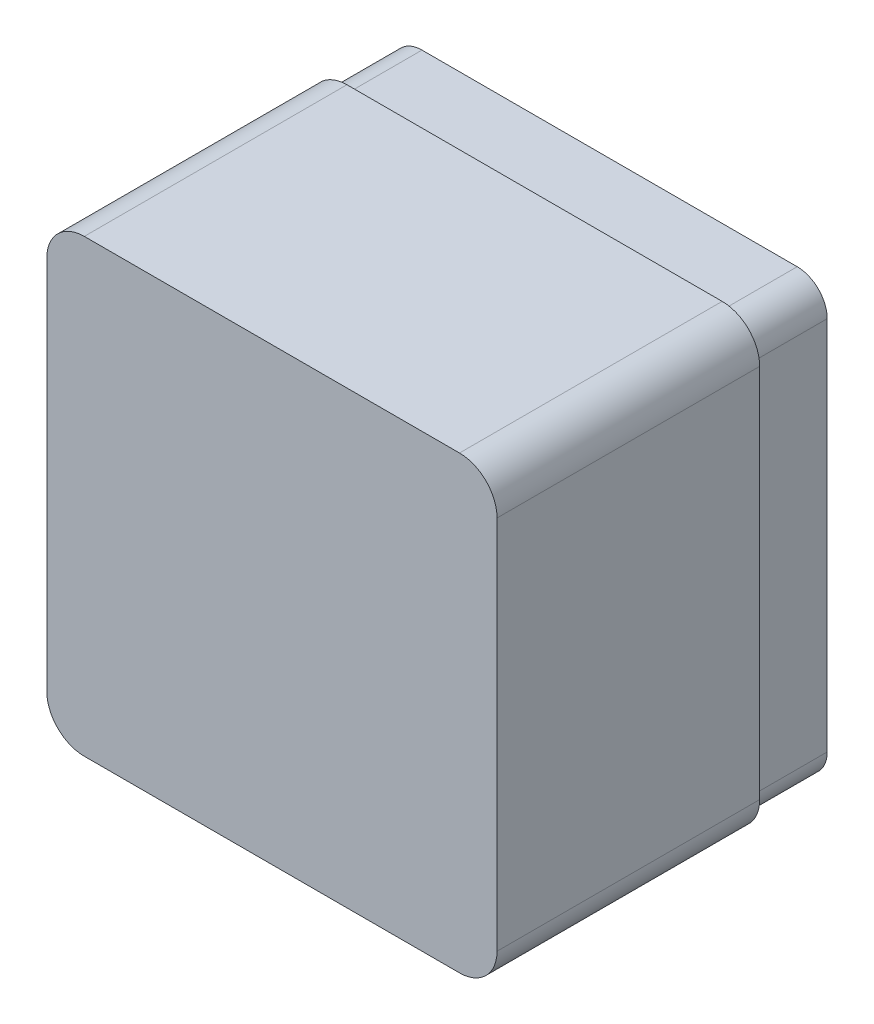
ISO-10303-21;
HEADER;
FILE_DESCRIPTION(('STEP AP214'),'2;1');
FILE_NAME('part.step','',(''),(''),'','','');
FILE_SCHEMA(('AUTOMOTIVE_DESIGN { 1 0 10303 214 1 1 1 1 }'));
ENDSEC;
DATA;
#1=APPLICATION_CONTEXT('core data for automotive mechanical design processes');
#2=APPLICATION_PROTOCOL_DEFINITION('international standard','automotive_design',2000,#1);
#3=PRODUCT_CONTEXT('',#1,'mechanical');
#4=PRODUCT('Part','Part','',(#3));
#5=PRODUCT_RELATED_PRODUCT_CATEGORY('part','',(#4));
#6=PRODUCT_DEFINITION_FORMATION('','',#4);
#7=PRODUCT_DEFINITION_CONTEXT('part definition',#1,'design');
#8=PRODUCT_DEFINITION('design','',#6,#7);
#9=PRODUCT_DEFINITION_SHAPE('','',#8);
#10=(LENGTH_UNIT() NAMED_UNIT(*) SI_UNIT(.MILLI.,.METRE.));
#11=(NAMED_UNIT(*) PLANE_ANGLE_UNIT() SI_UNIT($,.RADIAN.));
#12=(NAMED_UNIT(*) SI_UNIT($,.STERADIAN.) SOLID_ANGLE_UNIT());
#13=UNCERTAINTY_MEASURE_WITH_UNIT(LENGTH_MEASURE(1.E-05),#10,'distance_accuracy_value','');
#14=(GEOMETRIC_REPRESENTATION_CONTEXT(3) GLOBAL_UNCERTAINTY_ASSIGNED_CONTEXT((#13)) GLOBAL_UNIT_ASSIGNED_CONTEXT((#10,
#11,#12)) REPRESENTATION_CONTEXT('',''));
#15=CARTESIAN_POINT('',(0.,0.,0.));
#16=DIRECTION('',(0.,0.,1.));
#17=DIRECTION('',(1.,0.,0.));
#18=AXIS2_PLACEMENT_3D('',#15,#16,#17);
#19=CARTESIAN_POINT('',(0.,0.,0.));
#20=DIRECTION('',(0.,0.,-1.));
#21=DIRECTION('',(-1.,0.,0.));
#22=AXIS2_PLACEMENT_3D('',#19,#20,#21);
#23=PLANE('',#22);
#24=DIRECTION('',(1.,0.,0.));
#25=VECTOR('',#24,1.);
#26=CARTESIAN_POINT('',(0.,116.,0.));
#27=LINE('',#26,#25);
#28=CARTESIAN_POINT('',(10.0000000000001,116.,0.));
#29=VERTEX_POINT('',#28);
#30=CARTESIAN_POINT('',(110.,116.,0.));
#31=VERTEX_POINT('',#30);
#32=EDGE_CURVE('E329',#29,#31,#27,.T.);
#33=ORIENTED_EDGE('',*,*,#32,.F.);
#34=CARTESIAN_POINT('',(10.0000000000001,110.,0.));
#35=DIRECTION('',(0.,0.,-1.));
#36=DIRECTION('',(-1.,0.,0.));
#37=AXIS2_PLACEMENT_3D('',#34,#35,#36);
#38=CIRCLE('',#37,6.);
#39=CARTESIAN_POINT('',(4.00000000000007,110.,0.));
#40=VERTEX_POINT('',#39);
#41=EDGE_CURVE('E326',#40,#29,#38,.T.);
#42=ORIENTED_EDGE('',*,*,#41,.F.);
#43=DIRECTION('',(0.,1.,0.));
#44=VECTOR('',#43,1.);
#45=CARTESIAN_POINT('',(4.,0.,0.));
#46=LINE('',#45,#44);
#47=CARTESIAN_POINT('',(4.00000000000001,10.,0.));
#48=VERTEX_POINT('',#47);
#49=EDGE_CURVE('E286',#48,#40,#46,.T.);
#50=ORIENTED_EDGE('',*,*,#49,.F.);
#51=CARTESIAN_POINT('',(10.,10.,0.));
#52=DIRECTION('',(0.,0.,-1.));
#53=DIRECTION('',(-1.,0.,0.));
#54=AXIS2_PLACEMENT_3D('',#51,#52,#53);
#55=CIRCLE('',#54,6.);
#56=CARTESIAN_POINT('',(10.,4.,0.));
#57=VERTEX_POINT('',#56);
#58=EDGE_CURVE('E336',#57,#48,#55,.T.);
#59=ORIENTED_EDGE('',*,*,#58,.F.);
#60=DIRECTION('',(1.,0.,0.));
#61=VECTOR('',#60,1.);
#62=CARTESIAN_POINT('',(0.,4.,0.));
#63=LINE('',#62,#61);
#64=CARTESIAN_POINT('',(110.,4.,0.));
#65=VERTEX_POINT('',#64);
#66=EDGE_CURVE('E295',#57,#65,#63,.T.);
#67=ORIENTED_EDGE('',*,*,#66,.T.);
#68=CARTESIAN_POINT('',(110.,10.,0.));
#69=DIRECTION('',(0.,0.,-1.));
#70=DIRECTION('',(-1.,0.,0.));
#71=AXIS2_PLACEMENT_3D('',#68,#69,#70);
#72=CIRCLE('',#71,6.);
#73=CARTESIAN_POINT('',(116.,10.,0.));
#74=VERTEX_POINT('',#73);
#75=EDGE_CURVE('E331',#74,#65,#72,.T.);
#76=ORIENTED_EDGE('',*,*,#75,.F.);
#77=DIRECTION('',(0.,1.,0.));
#78=VECTOR('',#77,1.);
#79=CARTESIAN_POINT('',(116.,0.,0.));
#80=LINE('',#79,#78);
#81=CARTESIAN_POINT('',(116.,110.,0.));
#82=VERTEX_POINT('',#81);
#83=EDGE_CURVE('E334',#74,#82,#80,.T.);
#84=ORIENTED_EDGE('',*,*,#83,.T.);
#85=CARTESIAN_POINT('',(110.,110.,0.));
#86=DIRECTION('',(0.,0.,-1.));
#87=DIRECTION('',(-1.,0.,0.));
#88=AXIS2_PLACEMENT_3D('',#85,#86,#87);
#89=CIRCLE('',#88,6.);
#90=EDGE_CURVE('E322',#31,#82,#89,.T.);
#91=ORIENTED_EDGE('',*,*,#90,.F.);
#92=EDGE_LOOP('',(#33,#42,#50,#59,#67,#76,#84,#91));
#93=FACE_BOUND('',#92,.T.);
#94=DIRECTION('',(0.,1.,0.));
#95=VECTOR('',#94,1.);
#96=CARTESIAN_POINT('',(2.00000000000001,10.,0.));
#97=LINE('',#96,#95);
#98=CARTESIAN_POINT('',(2.00000000000001,10.,0.));
#99=VERTEX_POINT('',#98);
#100=CARTESIAN_POINT('',(2.00000000000001,110.,0.));
#101=VERTEX_POINT('',#100);
#102=EDGE_CURVE('E224',#99,#101,#97,.T.);
#103=ORIENTED_EDGE('',*,*,#102,.T.);
#104=CARTESIAN_POINT('',(10.0000000000001,110.,0.));
#105=DIRECTION('',(0.,0.,-1.));
#106=DIRECTION('',(-1.,0.,0.));
#107=AXIS2_PLACEMENT_3D('',#104,#105,#106);
#108=CIRCLE('',#107,8.00000000000003);
#109=CARTESIAN_POINT('',(10.0000000000001,118.,0.));
#110=VERTEX_POINT('',#109);
#111=EDGE_CURVE('E244',#101,#110,#108,.T.);
#112=ORIENTED_EDGE('',*,*,#111,.T.);
#113=DIRECTION('',(1.,0.,0.));
#114=VECTOR('',#113,1.);
#115=CARTESIAN_POINT('',(10.0000000000001,118.,0.));
#116=LINE('',#115,#114);
#117=CARTESIAN_POINT('',(110.,118.,0.));
#118=VERTEX_POINT('',#117);
#119=EDGE_CURVE('E204',#110,#118,#116,.T.);
#120=ORIENTED_EDGE('',*,*,#119,.T.);
#121=CARTESIAN_POINT('',(110.,110.,0.));
#122=DIRECTION('',(0.,0.,-1.));
#123=DIRECTION('',(-1.,0.,0.));
#124=AXIS2_PLACEMENT_3D('',#121,#122,#123);
#125=CIRCLE('',#124,7.99999999999999);
#126=CARTESIAN_POINT('',(118.,110.,0.));
#127=VERTEX_POINT('',#126);
#128=EDGE_CURVE('E53',#118,#127,#125,.T.);
#129=ORIENTED_EDGE('',*,*,#128,.T.);
#130=DIRECTION('',(0.,-1.,0.));
#131=VECTOR('',#130,1.);
#132=CARTESIAN_POINT('',(118.,110.,0.));
#133=LINE('',#132,#131);
#134=CARTESIAN_POINT('',(118.,9.99999999999999,0.));
#135=VERTEX_POINT('',#134);
#136=EDGE_CURVE('E248',#127,#135,#133,.T.);
#137=ORIENTED_EDGE('',*,*,#136,.T.);
#138=CARTESIAN_POINT('',(110.,10.,0.));
#139=DIRECTION('',(0.,0.,-1.));
#140=DIRECTION('',(-1.,0.,0.));
#141=AXIS2_PLACEMENT_3D('',#138,#139,#140);
#142=CIRCLE('',#141,7.99999999999998);
#143=CARTESIAN_POINT('',(110.,2.00000000000002,0.));
#144=VERTEX_POINT('',#143);
#145=EDGE_CURVE('E251',#135,#144,#142,.T.);
#146=ORIENTED_EDGE('',*,*,#145,.T.);
#147=DIRECTION('',(-1.,0.,0.));
#148=VECTOR('',#147,1.);
#149=CARTESIAN_POINT('',(110.,2.,0.));
#150=LINE('',#149,#148);
#151=CARTESIAN_POINT('',(10.,2.,0.));
#152=VERTEX_POINT('',#151);
#153=EDGE_CURVE('E254',#144,#152,#150,.T.);
#154=ORIENTED_EDGE('',*,*,#153,.T.);
#155=CARTESIAN_POINT('',(10.,10.,0.));
#156=DIRECTION('',(0.,0.,-1.));
#157=DIRECTION('',(-1.,0.,0.));
#158=AXIS2_PLACEMENT_3D('',#155,#156,#157);
#159=CIRCLE('',#158,8.);
#160=EDGE_CURVE('E227',#152,#99,#159,.T.);
#161=ORIENTED_EDGE('',*,*,#160,.T.);
#162=EDGE_LOOP('',(#103,#112,#120,#129,#137,#146,#154,#161));
#163=FACE_BOUND('',#162,.T.);
#164=ADVANCED_FACE('F38',(#93,#163),#23,.T.);
#165=CARTESIAN_POINT('',(4.,0.,90.));
#166=DIRECTION('',(-1.,0.,0.));
#167=DIRECTION('',(0.,-1.,0.));
#168=AXIS2_PLACEMENT_3D('',#165,#166,#167);
#169=PLANE('',#168);
#170=ORIENTED_EDGE('',*,*,#49,.T.);
#171=DIRECTION('',(0.,0.,1.));
#172=VECTOR('',#171,1.);
#173=CARTESIAN_POINT('',(4.00000000000008,110.,90.));
#174=LINE('',#173,#172);
#175=CARTESIAN_POINT('',(4.00000000000008,110.,86.));
#176=VERTEX_POINT('',#175);
#177=EDGE_CURVE('E290',#176,#40,#174,.F.);
#178=ORIENTED_EDGE('',*,*,#177,.F.);
#179=DIRECTION('',(0.,1.,0.));
#180=VECTOR('',#179,1.);
#181=CARTESIAN_POINT('',(4.,0.,86.));
#182=LINE('',#181,#180);
#183=CARTESIAN_POINT('',(4.00000000000001,10.,86.));
#184=VERTEX_POINT('',#183);
#185=EDGE_CURVE('E291',#184,#176,#182,.T.);
#186=ORIENTED_EDGE('',*,*,#185,.F.);
#187=DIRECTION('',(0.,0.,1.));
#188=VECTOR('',#187,1.);
#189=CARTESIAN_POINT('',(4.00000000000001,10.,90.));
#190=LINE('',#189,#188);
#191=EDGE_CURVE('E287',#48,#184,#190,.T.);
#192=ORIENTED_EDGE('',*,*,#191,.F.);
#193=EDGE_LOOP('',(#170,#178,#186,#192));
#194=FACE_BOUND('',#193,.T.);
#195=ADVANCED_FACE('F428',(#194),#169,.F.);
#196=CARTESIAN_POINT('',(0.,4.,90.));
#197=DIRECTION('',(0.,1.,0.));
#198=DIRECTION('',(0.,0.,1.));
#199=AXIS2_PLACEMENT_3D('',#196,#197,#198);
#200=PLANE('',#199);
#201=DIRECTION('',(1.,0.,0.));
#202=VECTOR('',#201,1.);
#203=CARTESIAN_POINT('',(0.,4.,86.));
#204=LINE('',#203,#202);
#205=CARTESIAN_POINT('',(10.,4.,86.));
#206=VERTEX_POINT('',#205);
#207=CARTESIAN_POINT('',(110.,4.,86.));
#208=VERTEX_POINT('',#207);
#209=EDGE_CURVE('E302',#206,#208,#204,.T.);
#210=ORIENTED_EDGE('',*,*,#209,.T.);
#211=DIRECTION('',(0.,0.,1.));
#212=VECTOR('',#211,1.);
#213=CARTESIAN_POINT('',(110.,4.,90.));
#214=LINE('',#213,#212);
#215=EDGE_CURVE('E305',#65,#208,#214,.T.);
#216=ORIENTED_EDGE('',*,*,#215,.F.);
#217=ORIENTED_EDGE('',*,*,#66,.F.);
#218=DIRECTION('',(0.,0.,1.));
#219=VECTOR('',#218,1.);
#220=CARTESIAN_POINT('',(10.,4.,90.));
#221=LINE('',#220,#219);
#222=EDGE_CURVE('E298',#206,#57,#221,.F.);
#223=ORIENTED_EDGE('',*,*,#222,.F.);
#224=EDGE_LOOP('',(#210,#216,#217,#223));
#225=FACE_BOUND('',#224,.T.);
#226=ADVANCED_FACE('F433',(#225),#200,.T.);
#227=CARTESIAN_POINT('',(116.,0.,90.));
#228=DIRECTION('',(-1.,0.,0.));
#229=DIRECTION('',(0.,-1.,0.));
#230=AXIS2_PLACEMENT_3D('',#227,#228,#229);
#231=PLANE('',#230);
#232=ORIENTED_EDGE('',*,*,#83,.F.);
#233=DIRECTION('',(0.,0.,1.));
#234=VECTOR('',#233,1.);
#235=CARTESIAN_POINT('',(116.,10.,90.));
#236=LINE('',#235,#234);
#237=CARTESIAN_POINT('',(116.,10.,86.));
#238=VERTEX_POINT('',#237);
#239=EDGE_CURVE('E320',#238,#74,#236,.F.);
#240=ORIENTED_EDGE('',*,*,#239,.F.);
#241=DIRECTION('',(0.,1.,0.));
#242=VECTOR('',#241,1.);
#243=CARTESIAN_POINT('',(116.,0.,86.));
#244=LINE('',#243,#242);
#245=CARTESIAN_POINT('',(116.,110.,86.));
#246=VERTEX_POINT('',#245);
#247=EDGE_CURVE('E299',#238,#246,#244,.T.);
#248=ORIENTED_EDGE('',*,*,#247,.T.);
#249=DIRECTION('',(0.,0.,1.));
#250=VECTOR('',#249,1.);
#251=CARTESIAN_POINT('',(116.,110.,90.));
#252=LINE('',#251,#250);
#253=EDGE_CURVE('E312',#82,#246,#252,.T.);
#254=ORIENTED_EDGE('',*,*,#253,.F.);
#255=EDGE_LOOP('',(#232,#240,#248,#254));
#256=FACE_BOUND('',#255,.T.);
#257=ADVANCED_FACE('F615',(#256),#231,.T.);
#258=CARTESIAN_POINT('',(0.,116.,90.));
#259=DIRECTION('',(0.,1.,0.));
#260=DIRECTION('',(0.,0.,1.));
#261=AXIS2_PLACEMENT_3D('',#258,#259,#260);
#262=PLANE('',#261);
#263=DIRECTION('',(1.,0.,0.));
#264=VECTOR('',#263,1.);
#265=CARTESIAN_POINT('',(0.,116.,86.));
#266=LINE('',#265,#264);
#267=CARTESIAN_POINT('',(10.0000000000001,116.,86.));
#268=VERTEX_POINT('',#267);
#269=CARTESIAN_POINT('',(110.,116.,86.));
#270=VERTEX_POINT('',#269);
#271=EDGE_CURVE('E294',#268,#270,#266,.T.);
#272=ORIENTED_EDGE('',*,*,#271,.F.);
#273=DIRECTION('',(0.,0.,1.));
#274=VECTOR('',#273,1.);
#275=CARTESIAN_POINT('',(10.0000000000001,116.,90.));
#276=LINE('',#275,#274);
#277=EDGE_CURVE('E316',#29,#268,#276,.T.);
#278=ORIENTED_EDGE('',*,*,#277,.F.);
#279=ORIENTED_EDGE('',*,*,#32,.T.);
#280=DIRECTION('',(0.,0.,1.));
#281=VECTOR('',#280,1.);
#282=CARTESIAN_POINT('',(110.,116.,90.));
#283=LINE('',#282,#281);
#284=EDGE_CURVE('E324',#270,#31,#283,.F.);
#285=ORIENTED_EDGE('',*,*,#284,.F.);
#286=EDGE_LOOP('',(#272,#278,#279,#285));
#287=FACE_BOUND('',#286,.T.);
#288=ADVANCED_FACE('F606',(#287),#262,.F.);
#289=CARTESIAN_POINT('',(0.,0.,86.));
#290=DIRECTION('',(0.,0.,-1.));
#291=DIRECTION('',(-1.,0.,0.));
#292=AXIS2_PLACEMENT_3D('',#289,#290,#291);
#293=PLANE('',#292);
#294=ORIENTED_EDGE('',*,*,#247,.F.);
#295=CARTESIAN_POINT('',(110.,10.,86.));
#296=DIRECTION('',(0.,0.,-1.));
#297=DIRECTION('',(-1.,0.,0.));
#298=AXIS2_PLACEMENT_3D('',#295,#296,#297);
#299=CIRCLE('',#298,6.);
#300=EDGE_CURVE('E311',#208,#238,#299,.F.);
#301=ORIENTED_EDGE('',*,*,#300,.F.);
#302=ORIENTED_EDGE('',*,*,#209,.F.);
#303=CARTESIAN_POINT('',(10.,10.,86.));
#304=DIRECTION('',(0.,0.,-1.));
#305=DIRECTION('',(-1.,0.,0.));
#306=AXIS2_PLACEMENT_3D('',#303,#304,#305);
#307=CIRCLE('',#306,6.);
#308=EDGE_CURVE('E306',#184,#206,#307,.F.);
#309=ORIENTED_EDGE('',*,*,#308,.F.);
#310=ORIENTED_EDGE('',*,*,#185,.T.);
#311=CARTESIAN_POINT('',(10.0000000000001,110.,86.));
#312=DIRECTION('',(0.,0.,-1.));
#313=DIRECTION('',(-1.,0.,0.));
#314=AXIS2_PLACEMENT_3D('',#311,#312,#313);
#315=CIRCLE('',#314,6.);
#316=EDGE_CURVE('E309',#268,#176,#315,.F.);
#317=ORIENTED_EDGE('',*,*,#316,.F.);
#318=ORIENTED_EDGE('',*,*,#271,.T.);
#319=CARTESIAN_POINT('',(110.,110.,86.));
#320=DIRECTION('',(0.,0.,-1.));
#321=DIRECTION('',(-1.,0.,0.));
#322=AXIS2_PLACEMENT_3D('',#319,#320,#321);
#323=CIRCLE('',#322,6.);
#324=EDGE_CURVE('E303',#246,#270,#323,.F.);
#325=ORIENTED_EDGE('',*,*,#324,.F.);
#326=EDGE_LOOP('',(#294,#301,#302,#309,#310,#317,#318,#325));
#327=FACE_BOUND('',#326,.T.);
#328=ADVANCED_FACE('F597',(#327),#293,.T.);
#329=CARTESIAN_POINT('',(110.,110.,90.));
#330=DIRECTION('',(0.,0.,1.));
#331=DIRECTION('',(1.,0.,0.));
#332=AXIS2_PLACEMENT_3D('',#329,#330,#331);
#333=CYLINDRICAL_SURFACE('',#332,6.);
#334=ORIENTED_EDGE('',*,*,#324,.T.);
#335=ORIENTED_EDGE('',*,*,#284,.T.);
#336=ORIENTED_EDGE('',*,*,#90,.T.);
#337=ORIENTED_EDGE('',*,*,#253,.T.);
#338=EDGE_LOOP('',(#334,#335,#336,#337));
#339=FACE_BOUND('',#338,.T.);
#340=ADVANCED_FACE('F588',(#339),#333,.F.);
#341=CARTESIAN_POINT('',(10.,10.,90.));
#342=DIRECTION('',(0.,0.,1.));
#343=DIRECTION('',(1.,0.,0.));
#344=AXIS2_PLACEMENT_3D('',#341,#342,#343);
#345=CYLINDRICAL_SURFACE('',#344,6.);
#346=ORIENTED_EDGE('',*,*,#308,.T.);
#347=ORIENTED_EDGE('',*,*,#222,.T.);
#348=ORIENTED_EDGE('',*,*,#58,.T.);
#349=ORIENTED_EDGE('',*,*,#191,.T.);
#350=EDGE_LOOP('',(#346,#347,#348,#349));
#351=FACE_BOUND('',#350,.T.);
#352=ADVANCED_FACE('F579',(#351),#345,.F.);
#353=CARTESIAN_POINT('',(110.,10.,90.));
#354=DIRECTION('',(0.,0.,-1.));
#355=DIRECTION('',(-1.,0.,0.));
#356=AXIS2_PLACEMENT_3D('',#353,#354,#355);
#357=CYLINDRICAL_SURFACE('',#356,6.);
#358=ORIENTED_EDGE('',*,*,#300,.T.);
#359=ORIENTED_EDGE('',*,*,#239,.T.);
#360=ORIENTED_EDGE('',*,*,#75,.T.);
#361=ORIENTED_EDGE('',*,*,#215,.T.);
#362=EDGE_LOOP('',(#358,#359,#360,#361));
#363=FACE_BOUND('',#362,.T.);
#364=ADVANCED_FACE('F571',(#363),#357,.F.);
#365=CARTESIAN_POINT('',(10.0000000000001,110.,90.));
#366=DIRECTION('',(0.,0.,-1.));
#367=DIRECTION('',(-1.,0.,0.));
#368=AXIS2_PLACEMENT_3D('',#365,#366,#367);
#369=CYLINDRICAL_SURFACE('',#368,6.);
#370=ORIENTED_EDGE('',*,*,#316,.T.);
#371=ORIENTED_EDGE('',*,*,#177,.T.);
#372=ORIENTED_EDGE('',*,*,#41,.T.);
#373=ORIENTED_EDGE('',*,*,#277,.T.);
#374=EDGE_LOOP('',(#370,#371,#372,#373));
#375=FACE_BOUND('',#374,.T.);
#376=ADVANCED_FACE('F486',(#375),#369,.F.);
#377=CARTESIAN_POINT('',(10.0000000000001,110.,20.));
#378=DIRECTION('',(0.,0.,-1.));
#379=DIRECTION('',(-1.,0.,0.));
#380=AXIS2_PLACEMENT_3D('',#377,#378,#379);
#381=PLANE('',#380);
#382=DIRECTION('',(0.,1.,0.));
#383=VECTOR('',#382,1.);
#384=CARTESIAN_POINT('',(2.00000000000001,10.,20.));
#385=LINE('',#384,#383);
#386=CARTESIAN_POINT('',(2.00000000000001,10.,20.));
#387=VERTEX_POINT('',#386);
#388=CARTESIAN_POINT('',(2.00000000000001,110.,20.));
#389=VERTEX_POINT('',#388);
#390=EDGE_CURVE('E210',#387,#389,#385,.T.);
#391=ORIENTED_EDGE('',*,*,#390,.F.);
#392=CARTESIAN_POINT('',(10.,10.,20.));
#393=DIRECTION('',(0.,0.,-1.));
#394=DIRECTION('',(-1.,0.,0.));
#395=AXIS2_PLACEMENT_3D('',#392,#393,#394);
#396=CIRCLE('',#395,8.);
#397=CARTESIAN_POINT('',(10.,2.,20.));
#398=VERTEX_POINT('',#397);
#399=EDGE_CURVE('E240',#398,#387,#396,.T.);
#400=ORIENTED_EDGE('',*,*,#399,.F.);
#401=DIRECTION('',(-1.,0.,0.));
#402=VECTOR('',#401,1.);
#403=CARTESIAN_POINT('',(110.,2.,20.));
#404=LINE('',#403,#402);
#405=CARTESIAN_POINT('',(110.,2.00000000000002,20.));
#406=VERTEX_POINT('',#405);
#407=EDGE_CURVE('E237',#406,#398,#404,.T.);
#408=ORIENTED_EDGE('',*,*,#407,.F.);
#409=CARTESIAN_POINT('',(110.,10.,20.));
#410=DIRECTION('',(0.,0.,-1.));
#411=DIRECTION('',(-1.,0.,0.));
#412=AXIS2_PLACEMENT_3D('',#409,#410,#411);
#413=CIRCLE('',#412,7.99999999999998);
#414=CARTESIAN_POINT('',(118.,9.99999999999999,20.));
#415=VERTEX_POINT('',#414);
#416=EDGE_CURVE('E234',#415,#406,#413,.T.);
#417=ORIENTED_EDGE('',*,*,#416,.F.);
#418=DIRECTION('',(0.,-1.,0.));
#419=VECTOR('',#418,1.);
#420=CARTESIAN_POINT('',(118.,110.,20.));
#421=LINE('',#420,#419);
#422=CARTESIAN_POINT('',(118.,110.,20.));
#423=VERTEX_POINT('',#422);
#424=EDGE_CURVE('E231',#423,#415,#421,.T.);
#425=ORIENTED_EDGE('',*,*,#424,.F.);
#426=CARTESIAN_POINT('',(110.,110.,20.));
#427=DIRECTION('',(0.,0.,-1.));
#428=DIRECTION('',(-1.,0.,0.));
#429=AXIS2_PLACEMENT_3D('',#426,#427,#428);
#430=CIRCLE('',#429,7.99999999999999);
#431=CARTESIAN_POINT('',(110.,118.,20.));
#432=VERTEX_POINT('',#431);
#433=EDGE_CURVE('E220',#432,#423,#430,.T.);
#434=ORIENTED_EDGE('',*,*,#433,.F.);
#435=DIRECTION('',(1.,0.,0.));
#436=VECTOR('',#435,1.);
#437=CARTESIAN_POINT('',(10.0000000000001,118.,20.));
#438=LINE('',#437,#436);
#439=CARTESIAN_POINT('',(10.0000000000001,118.,20.));
#440=VERTEX_POINT('',#439);
#441=EDGE_CURVE('E202',#440,#432,#438,.T.);
#442=ORIENTED_EDGE('',*,*,#441,.F.);
#443=CARTESIAN_POINT('',(10.0000000000001,110.,20.));
#444=DIRECTION('',(0.,0.,-1.));
#445=DIRECTION('',(-1.,0.,0.));
#446=AXIS2_PLACEMENT_3D('',#443,#444,#445);
#447=CIRCLE('',#446,8.00000000000003);
#448=EDGE_CURVE('E216',#389,#440,#447,.T.);
#449=ORIENTED_EDGE('',*,*,#448,.F.);
#450=EDGE_LOOP('',(#391,#400,#408,#417,#425,#434,#442,#449));
#451=FACE_BOUND('',#450,.T.);
#452=CARTESIAN_POINT('',(10.0000000000001,110.,20.));
#453=DIRECTION('',(0.,0.,-1.));
#454=DIRECTION('',(-1.,0.,0.));
#455=AXIS2_PLACEMENT_3D('',#452,#453,#454);
#456=CIRCLE('',#455,10.);
#457=CARTESIAN_POINT('',(0.,110.,20.));
#458=VERTEX_POINT('',#457);
#459=CARTESIAN_POINT('',(10.0000000000001,120.,20.));
#460=VERTEX_POINT('',#459);
#461=EDGE_CURVE('E260',#458,#460,#456,.T.);
#462=ORIENTED_EDGE('',*,*,#461,.T.);
#463=DIRECTION('',(1.,0.,0.));
#464=VECTOR('',#463,1.);
#465=CARTESIAN_POINT('',(10.0000000000001,120.,20.));
#466=LINE('',#465,#464);
#467=CARTESIAN_POINT('',(110.,120.,20.));
#468=VERTEX_POINT('',#467);
#469=EDGE_CURVE('E273',#460,#468,#466,.T.);
#470=ORIENTED_EDGE('',*,*,#469,.T.);
#471=CARTESIAN_POINT('',(110.,110.,20.));
#472=DIRECTION('',(0.,0.,-1.));
#473=DIRECTION('',(-1.,0.,0.));
#474=AXIS2_PLACEMENT_3D('',#471,#472,#473);
#475=CIRCLE('',#474,9.99999999999999);
#476=CARTESIAN_POINT('',(120.,110.,20.));
#477=VERTEX_POINT('',#476);
#478=EDGE_CURVE('E275',#468,#477,#475,.T.);
#479=ORIENTED_EDGE('',*,*,#478,.T.);
#480=DIRECTION('',(0.,-1.,0.));
#481=VECTOR('',#480,1.);
#482=CARTESIAN_POINT('',(120.,110.,20.));
#483=LINE('',#482,#481);
#484=CARTESIAN_POINT('',(120.,10.,20.));
#485=VERTEX_POINT('',#484);
#486=EDGE_CURVE('E277',#477,#485,#483,.T.);
#487=ORIENTED_EDGE('',*,*,#486,.T.);
#488=CARTESIAN_POINT('',(110.,10.,20.));
#489=DIRECTION('',(0.,0.,-1.));
#490=DIRECTION('',(-1.,0.,0.));
#491=AXIS2_PLACEMENT_3D('',#488,#489,#490);
#492=CIRCLE('',#491,9.99999999999999);
#493=CARTESIAN_POINT('',(110.,0.,20.));
#494=VERTEX_POINT('',#493);
#495=EDGE_CURVE('E279',#485,#494,#492,.T.);
#496=ORIENTED_EDGE('',*,*,#495,.T.);
#497=DIRECTION('',(-1.,0.,0.));
#498=VECTOR('',#497,1.);
#499=CARTESIAN_POINT('',(110.,0.,20.));
#500=LINE('',#499,#498);
#501=CARTESIAN_POINT('',(10.,0.,20.));
#502=VERTEX_POINT('',#501);
#503=EDGE_CURVE('E281',#494,#502,#500,.T.);
#504=ORIENTED_EDGE('',*,*,#503,.T.);
#505=CARTESIAN_POINT('',(10.,10.,20.));
#506=DIRECTION('',(0.,0.,-1.));
#507=DIRECTION('',(-1.,0.,0.));
#508=AXIS2_PLACEMENT_3D('',#505,#506,#507);
#509=CIRCLE('',#508,10.);
#510=CARTESIAN_POINT('',(0.,10.,20.));
#511=VERTEX_POINT('',#510);
#512=EDGE_CURVE('E283',#502,#511,#509,.T.);
#513=ORIENTED_EDGE('',*,*,#512,.T.);
#514=DIRECTION('',(0.,1.,0.));
#515=VECTOR('',#514,1.);
#516=CARTESIAN_POINT('',(0.,10.,20.));
#517=LINE('',#516,#515);
#518=EDGE_CURVE('E61',#511,#458,#517,.T.);
#519=ORIENTED_EDGE('',*,*,#518,.T.);
#520=EDGE_LOOP('',(#462,#470,#479,#487,#496,#504,#513,#519));
#521=FACE_BOUND('',#520,.T.);
#522=ADVANCED_FACE('F215',(#451,#521),#381,.T.);
#523=CARTESIAN_POINT('',(10.0000000000001,110.,20.));
#524=DIRECTION('',(0.,0.,-1.));
#525=DIRECTION('',(-1.,0.,0.));
#526=AXIS2_PLACEMENT_3D('',#523,#524,#525);
#527=CYLINDRICAL_SURFACE('',#526,8.00000000000003);
#528=ORIENTED_EDGE('',*,*,#111,.F.);
#529=DIRECTION('',(0.,0.,-1.));
#530=VECTOR('',#529,1.);
#531=CARTESIAN_POINT('',(2.00000000000001,110.,20.));
#532=LINE('',#531,#530);
#533=EDGE_CURVE('E223',#389,#101,#532,.T.);
#534=ORIENTED_EDGE('',*,*,#533,.F.);
#535=ORIENTED_EDGE('',*,*,#448,.T.);
#536=DIRECTION('',(0.,0.,-1.));
#537=VECTOR('',#536,1.);
#538=CARTESIAN_POINT('',(10.0000000000001,118.,20.));
#539=LINE('',#538,#537);
#540=EDGE_CURVE('E199',#440,#110,#539,.T.);
#541=ORIENTED_EDGE('',*,*,#540,.T.);
#542=EDGE_LOOP('',(#528,#534,#535,#541));
#543=FACE_BOUND('',#542,.T.);
#544=ADVANCED_FACE('F222',(#543),#527,.T.);
#545=CARTESIAN_POINT('',(2.00000000000001,10.,20.));
#546=DIRECTION('',(-1.,0.,0.));
#547=DIRECTION('',(0.,-1.,0.));
#548=AXIS2_PLACEMENT_3D('',#545,#546,#547);
#549=PLANE('',#548);
#550=ORIENTED_EDGE('',*,*,#102,.F.);
#551=DIRECTION('',(0.,0.,-1.));
#552=VECTOR('',#551,1.);
#553=CARTESIAN_POINT('',(2.00000000000001,10.,20.));
#554=LINE('',#553,#552);
#555=EDGE_CURVE('E261',#387,#99,#554,.T.);
#556=ORIENTED_EDGE('',*,*,#555,.F.);
#557=ORIENTED_EDGE('',*,*,#390,.T.);
#558=ORIENTED_EDGE('',*,*,#533,.T.);
#559=EDGE_LOOP('',(#550,#556,#557,#558));
#560=FACE_BOUND('',#559,.T.);
#561=ADVANCED_FACE('F494',(#560),#549,.T.);
#562=CARTESIAN_POINT('',(10.,10.,20.));
#563=DIRECTION('',(0.,0.,-1.));
#564=DIRECTION('',(-1.,0.,0.));
#565=AXIS2_PLACEMENT_3D('',#562,#563,#564);
#566=CYLINDRICAL_SURFACE('',#565,8.);
#567=ORIENTED_EDGE('',*,*,#160,.F.);
#568=DIRECTION('',(0.,0.,-1.));
#569=VECTOR('',#568,1.);
#570=CARTESIAN_POINT('',(10.,2.,20.));
#571=LINE('',#570,#569);
#572=EDGE_CURVE('E263',#398,#152,#571,.T.);
#573=ORIENTED_EDGE('',*,*,#572,.F.);
#574=ORIENTED_EDGE('',*,*,#399,.T.);
#575=ORIENTED_EDGE('',*,*,#555,.T.);
#576=EDGE_LOOP('',(#567,#573,#574,#575));
#577=FACE_BOUND('',#576,.T.);
#578=ADVANCED_FACE('F502',(#577),#566,.T.);
#579=CARTESIAN_POINT('',(110.,2.,20.));
#580=DIRECTION('',(0.,-1.,0.));
#581=DIRECTION('',(1.,0.,0.));
#582=AXIS2_PLACEMENT_3D('',#579,#580,#581);
#583=PLANE('',#582);
#584=ORIENTED_EDGE('',*,*,#153,.F.);
#585=DIRECTION('',(0.,0.,-1.));
#586=VECTOR('',#585,1.);
#587=CARTESIAN_POINT('',(110.,2.00000000000002,20.));
#588=LINE('',#587,#586);
#589=EDGE_CURVE('E265',#406,#144,#588,.T.);
#590=ORIENTED_EDGE('',*,*,#589,.F.);
#591=ORIENTED_EDGE('',*,*,#407,.T.);
#592=ORIENTED_EDGE('',*,*,#572,.T.);
#593=EDGE_LOOP('',(#584,#590,#591,#592));
#594=FACE_BOUND('',#593,.T.);
#595=ADVANCED_FACE('F511',(#594),#583,.T.);
#596=CARTESIAN_POINT('',(110.,10.,20.));
#597=DIRECTION('',(0.,0.,-1.));
#598=DIRECTION('',(-1.,0.,0.));
#599=AXIS2_PLACEMENT_3D('',#596,#597,#598);
#600=CYLINDRICAL_SURFACE('',#599,7.99999999999998);
#601=ORIENTED_EDGE('',*,*,#145,.F.);
#602=DIRECTION('',(0.,0.,-1.));
#603=VECTOR('',#602,1.);
#604=CARTESIAN_POINT('',(118.,9.99999999999999,20.));
#605=LINE('',#604,#603);
#606=EDGE_CURVE('E267',#415,#135,#605,.T.);
#607=ORIENTED_EDGE('',*,*,#606,.F.);
#608=ORIENTED_EDGE('',*,*,#416,.T.);
#609=ORIENTED_EDGE('',*,*,#589,.T.);
#610=EDGE_LOOP('',(#601,#607,#608,#609));
#611=FACE_BOUND('',#610,.T.);
#612=ADVANCED_FACE('F520',(#611),#600,.T.);
#613=CARTESIAN_POINT('',(118.,110.,20.));
#614=DIRECTION('',(1.,0.,0.));
#615=DIRECTION('',(0.,0.,-1.));
#616=AXIS2_PLACEMENT_3D('',#613,#614,#615);
#617=PLANE('',#616);
#618=ORIENTED_EDGE('',*,*,#136,.F.);
#619=DIRECTION('',(0.,0.,-1.));
#620=VECTOR('',#619,1.);
#621=CARTESIAN_POINT('',(118.,110.,20.));
#622=LINE('',#621,#620);
#623=EDGE_CURVE('E269',#423,#127,#622,.T.);
#624=ORIENTED_EDGE('',*,*,#623,.F.);
#625=ORIENTED_EDGE('',*,*,#424,.T.);
#626=ORIENTED_EDGE('',*,*,#606,.T.);
#627=EDGE_LOOP('',(#618,#624,#625,#626));
#628=FACE_BOUND('',#627,.T.);
#629=ADVANCED_FACE('F529',(#628),#617,.T.);
#630=CARTESIAN_POINT('',(110.,110.,20.));
#631=DIRECTION('',(0.,0.,-1.));
#632=DIRECTION('',(-1.,0.,0.));
#633=AXIS2_PLACEMENT_3D('',#630,#631,#632);
#634=CYLINDRICAL_SURFACE('',#633,7.99999999999999);
#635=ORIENTED_EDGE('',*,*,#128,.F.);
#636=DIRECTION('',(0.,0.,-1.));
#637=VECTOR('',#636,1.);
#638=CARTESIAN_POINT('',(110.,118.,20.));
#639=LINE('',#638,#637);
#640=EDGE_CURVE('E209',#432,#118,#639,.T.);
#641=ORIENTED_EDGE('',*,*,#640,.F.);
#642=ORIENTED_EDGE('',*,*,#433,.T.);
#643=ORIENTED_EDGE('',*,*,#623,.T.);
#644=EDGE_LOOP('',(#635,#641,#642,#643));
#645=FACE_BOUND('',#644,.T.);
#646=ADVANCED_FACE('F423',(#645),#634,.T.);
#647=CARTESIAN_POINT('',(10.0000000000001,118.,20.));
#648=DIRECTION('',(0.,1.,0.));
#649=DIRECTION('',(0.,0.,1.));
#650=AXIS2_PLACEMENT_3D('',#647,#648,#649);
#651=PLANE('',#650);
#652=ORIENTED_EDGE('',*,*,#119,.F.);
#653=ORIENTED_EDGE('',*,*,#540,.F.);
#654=ORIENTED_EDGE('',*,*,#441,.T.);
#655=ORIENTED_EDGE('',*,*,#640,.T.);
#656=EDGE_LOOP('',(#652,#653,#654,#655));
#657=FACE_BOUND('',#656,.T.);
#658=ADVANCED_FACE('F201',(#657),#651,.T.);
#659=CARTESIAN_POINT('',(0.,0.,90.));
#660=DIRECTION('',(0.,0.,-1.));
#661=DIRECTION('',(-1.,0.,0.));
#662=AXIS2_PLACEMENT_3D('',#659,#660,#661);
#663=PLANE('',#662);
#664=DIRECTION('',(0.,1.,0.));
#665=VECTOR('',#664,1.);
#666=CARTESIAN_POINT('',(120.,0.,90.));
#667=LINE('',#666,#665);
#668=CARTESIAN_POINT('',(120.,10.,90.));
#669=VERTEX_POINT('',#668);
#670=CARTESIAN_POINT('',(120.,110.,90.));
#671=VERTEX_POINT('',#670);
#672=EDGE_CURVE('E348',#669,#671,#667,.T.);
#673=ORIENTED_EDGE('',*,*,#672,.T.);
#674=CARTESIAN_POINT('',(110.,110.,90.));
#675=DIRECTION('',(0.,0.,-1.));
#676=DIRECTION('',(-1.,0.,0.));
#677=AXIS2_PLACEMENT_3D('',#674,#675,#676);
#678=CIRCLE('',#677,10.);
#679=CARTESIAN_POINT('',(110.,120.,90.));
#680=VERTEX_POINT('',#679);
#681=EDGE_CURVE('E370',#671,#680,#678,.F.);
#682=ORIENTED_EDGE('',*,*,#681,.T.);
#683=DIRECTION('',(1.,0.,0.));
#684=VECTOR('',#683,1.);
#685=CARTESIAN_POINT('',(0.,120.,90.));
#686=LINE('',#685,#684);
#687=CARTESIAN_POINT('',(10.0000000000001,120.,90.));
#688=VERTEX_POINT('',#687);
#689=EDGE_CURVE('E345',#688,#680,#686,.T.);
#690=ORIENTED_EDGE('',*,*,#689,.F.);
#691=CARTESIAN_POINT('',(10.0000000000001,110.,90.));
#692=DIRECTION('',(0.,0.,-1.));
#693=DIRECTION('',(-1.,0.,0.));
#694=AXIS2_PLACEMENT_3D('',#691,#692,#693);
#695=CIRCLE('',#694,10.);
#696=CARTESIAN_POINT('',(0.,110.,90.));
#697=VERTEX_POINT('',#696);
#698=EDGE_CURVE('E364',#688,#697,#695,.F.);
#699=ORIENTED_EDGE('',*,*,#698,.T.);
#700=DIRECTION('',(0.,1.,0.));
#701=VECTOR('',#700,1.);
#702=CARTESIAN_POINT('',(0.,0.,90.));
#703=LINE('',#702,#701);
#704=CARTESIAN_POINT('',(0.,10.,90.));
#705=VERTEX_POINT('',#704);
#706=EDGE_CURVE('E289',#705,#697,#703,.T.);
#707=ORIENTED_EDGE('',*,*,#706,.F.);
#708=CARTESIAN_POINT('',(10.,10.,90.));
#709=DIRECTION('',(0.,0.,-1.));
#710=DIRECTION('',(-1.,0.,0.));
#711=AXIS2_PLACEMENT_3D('',#708,#709,#710);
#712=CIRCLE('',#711,10.);
#713=CARTESIAN_POINT('',(10.,0.,90.));
#714=VERTEX_POINT('',#713);
#715=EDGE_CURVE('E368',#705,#714,#712,.F.);
#716=ORIENTED_EDGE('',*,*,#715,.T.);
#717=DIRECTION('',(1.,0.,0.));
#718=VECTOR('',#717,1.);
#719=CARTESIAN_POINT('',(0.,0.,90.));
#720=LINE('',#719,#718);
#721=CARTESIAN_POINT('',(110.,0.,90.));
#722=VERTEX_POINT('',#721);
#723=EDGE_CURVE('E351',#714,#722,#720,.T.);
#724=ORIENTED_EDGE('',*,*,#723,.T.);
#725=CARTESIAN_POINT('',(110.,10.,90.));
#726=DIRECTION('',(0.,0.,-1.));
#727=DIRECTION('',(-1.,0.,0.));
#728=AXIS2_PLACEMENT_3D('',#725,#726,#727);
#729=CIRCLE('',#728,10.);
#730=EDGE_CURVE('E366',#722,#669,#729,.F.);
#731=ORIENTED_EDGE('',*,*,#730,.T.);
#732=EDGE_LOOP('',(#673,#682,#690,#699,#707,#716,#724,#731));
#733=FACE_BOUND('',#732,.T.);
#734=ADVANCED_FACE('F415',(#733),#663,.F.);
#735=CARTESIAN_POINT('',(10.,10.,90.));
#736=DIRECTION('',(0.,0.,1.));
#737=DIRECTION('',(1.,0.,0.));
#738=AXIS2_PLACEMENT_3D('',#735,#736,#737);
#739=CYLINDRICAL_SURFACE('',#738,10.);
#740=DIRECTION('',(0.,0.,-1.));
#741=VECTOR('',#740,1.);
#742=CARTESIAN_POINT('',(0.,10.,90.));
#743=LINE('',#742,#741);
#744=EDGE_CURVE('E11',#511,#705,#743,.F.);
#745=ORIENTED_EDGE('',*,*,#744,.F.);
#746=ORIENTED_EDGE('',*,*,#512,.F.);
#747=DIRECTION('',(0.,0.,-1.));
#748=VECTOR('',#747,1.);
#749=CARTESIAN_POINT('',(10.,0.,0.));
#750=LINE('',#749,#748);
#751=EDGE_CURVE('E374',#714,#502,#750,.T.);
#752=ORIENTED_EDGE('',*,*,#751,.F.);
#753=ORIENTED_EDGE('',*,*,#715,.F.);
#754=EDGE_LOOP('',(#745,#746,#752,#753));
#755=FACE_BOUND('',#754,.T.);
#756=ADVANCED_FACE('F413',(#755),#739,.T.);
#757=CARTESIAN_POINT('',(110.,10.,90.));
#758=DIRECTION('',(0.,0.,-1.));
#759=DIRECTION('',(-1.,0.,0.));
#760=AXIS2_PLACEMENT_3D('',#757,#758,#759);
#761=CYLINDRICAL_SURFACE('',#760,10.);
#762=DIRECTION('',(0.,0.,-1.));
#763=VECTOR('',#762,1.);
#764=CARTESIAN_POINT('',(110.,0.,90.));
#765=LINE('',#764,#763);
#766=EDGE_CURVE('E372',#494,#722,#765,.F.);
#767=ORIENTED_EDGE('',*,*,#766,.F.);
#768=ORIENTED_EDGE('',*,*,#495,.F.);
#769=DIRECTION('',(0.,0.,-1.));
#770=VECTOR('',#769,1.);
#771=CARTESIAN_POINT('',(120.,10.,90.));
#772=LINE('',#771,#770);
#773=EDGE_CURVE('E359',#669,#485,#772,.T.);
#774=ORIENTED_EDGE('',*,*,#773,.F.);
#775=ORIENTED_EDGE('',*,*,#730,.F.);
#776=EDGE_LOOP('',(#767,#768,#774,#775));
#777=FACE_BOUND('',#776,.T.);
#778=ADVANCED_FACE('F404',(#777),#761,.T.);
#779=CARTESIAN_POINT('',(10.0000000000001,110.,90.));
#780=DIRECTION('',(0.,0.,-1.));
#781=DIRECTION('',(-1.,0.,0.));
#782=AXIS2_PLACEMENT_3D('',#779,#780,#781);
#783=CYLINDRICAL_SURFACE('',#782,10.);
#784=DIRECTION('',(0.,0.,-1.));
#785=VECTOR('',#784,1.);
#786=CARTESIAN_POINT('',(10.0000000000001,120.,90.));
#787=LINE('',#786,#785);
#788=EDGE_CURVE('E354',#460,#688,#787,.F.);
#789=ORIENTED_EDGE('',*,*,#788,.F.);
#790=ORIENTED_EDGE('',*,*,#461,.F.);
#791=DIRECTION('',(0.,0.,-1.));
#792=VECTOR('',#791,1.);
#793=CARTESIAN_POINT('',(0.,110.,90.));
#794=LINE('',#793,#792);
#795=EDGE_CURVE('E46',#697,#458,#794,.T.);
#796=ORIENTED_EDGE('',*,*,#795,.F.);
#797=ORIENTED_EDGE('',*,*,#698,.F.);
#798=EDGE_LOOP('',(#789,#790,#796,#797));
#799=FACE_BOUND('',#798,.T.);
#800=ADVANCED_FACE('F40',(#799),#783,.T.);
#801=CARTESIAN_POINT('',(110.,110.,90.));
#802=DIRECTION('',(0.,0.,1.));
#803=DIRECTION('',(1.,0.,0.));
#804=AXIS2_PLACEMENT_3D('',#801,#802,#803);
#805=CYLINDRICAL_SURFACE('',#804,10.);
#806=DIRECTION('',(0.,0.,-1.));
#807=VECTOR('',#806,1.);
#808=CARTESIAN_POINT('',(120.,110.,90.));
#809=LINE('',#808,#807);
#810=EDGE_CURVE('E362',#477,#671,#809,.F.);
#811=ORIENTED_EDGE('',*,*,#810,.F.);
#812=ORIENTED_EDGE('',*,*,#478,.F.);
#813=DIRECTION('',(0.,0.,-1.));
#814=VECTOR('',#813,1.);
#815=CARTESIAN_POINT('',(110.,120.,0.));
#816=LINE('',#815,#814);
#817=EDGE_CURVE('E356',#680,#468,#816,.T.);
#818=ORIENTED_EDGE('',*,*,#817,.F.);
#819=ORIENTED_EDGE('',*,*,#681,.F.);
#820=EDGE_LOOP('',(#811,#812,#818,#819));
#821=FACE_BOUND('',#820,.T.);
#822=ADVANCED_FACE('F394',(#821),#805,.T.);
#823=CARTESIAN_POINT('',(0.,120.,90.));
#824=DIRECTION('',(0.,1.,0.));
#825=DIRECTION('',(0.,0.,1.));
#826=AXIS2_PLACEMENT_3D('',#823,#824,#825);
#827=PLANE('',#826);
#828=ORIENTED_EDGE('',*,*,#817,.T.);
#829=ORIENTED_EDGE('',*,*,#469,.F.);
#830=ORIENTED_EDGE('',*,*,#788,.T.);
#831=ORIENTED_EDGE('',*,*,#689,.T.);
#832=EDGE_LOOP('',(#828,#829,#830,#831));
#833=FACE_BOUND('',#832,.T.);
#834=ADVANCED_FACE('F388',(#833),#827,.T.);
#835=CARTESIAN_POINT('',(120.,0.,90.));
#836=DIRECTION('',(-1.,0.,0.));
#837=DIRECTION('',(0.,-1.,0.));
#838=AXIS2_PLACEMENT_3D('',#835,#836,#837);
#839=PLANE('',#838);
#840=ORIENTED_EDGE('',*,*,#486,.F.);
#841=ORIENTED_EDGE('',*,*,#810,.T.);
#842=ORIENTED_EDGE('',*,*,#672,.F.);
#843=ORIENTED_EDGE('',*,*,#773,.T.);
#844=EDGE_LOOP('',(#840,#841,#842,#843));
#845=FACE_BOUND('',#844,.T.);
#846=ADVANCED_FACE('F398',(#845),#839,.F.);
#847=CARTESIAN_POINT('',(0.,0.,90.));
#848=DIRECTION('',(0.,1.,0.));
#849=DIRECTION('',(0.,0.,1.));
#850=AXIS2_PLACEMENT_3D('',#847,#848,#849);
#851=PLANE('',#850);
#852=ORIENTED_EDGE('',*,*,#503,.F.);
#853=ORIENTED_EDGE('',*,*,#766,.T.);
#854=ORIENTED_EDGE('',*,*,#723,.F.);
#855=ORIENTED_EDGE('',*,*,#751,.T.);
#856=EDGE_LOOP('',(#852,#853,#854,#855));
#857=FACE_BOUND('',#856,.T.);
#858=ADVANCED_FACE('F408',(#857),#851,.F.);
#859=CARTESIAN_POINT('',(0.,0.,90.));
#860=DIRECTION('',(-1.,0.,0.));
#861=DIRECTION('',(0.,-1.,0.));
#862=AXIS2_PLACEMENT_3D('',#859,#860,#861);
#863=PLANE('',#862);
#864=ORIENTED_EDGE('',*,*,#795,.T.);
#865=ORIENTED_EDGE('',*,*,#518,.F.);
#866=ORIENTED_EDGE('',*,*,#744,.T.);
#867=ORIENTED_EDGE('',*,*,#706,.T.);
#868=EDGE_LOOP('',(#864,#865,#866,#867));
#869=FACE_BOUND('',#868,.T.);
#870=ADVANCED_FACE('F379',(#869),#863,.T.);
#871=CLOSED_SHELL('',(#164,#195,#226,#257,#288,#328,#340,#352,#364,#376,#522,#544,#561,#578,
#595,#612,#629,#646,#658,#734,#756,#778,#800,#822,#834,#846,#858,#870));
#872=MANIFOLD_SOLID_BREP('B2',#871);
#873=ADVANCED_BREP_SHAPE_REPRESENTATION('',(#18,#872),#14);
#874=SHAPE_DEFINITION_REPRESENTATION(#9,#873);
ENDSEC;
END-ISO-10303-21;
